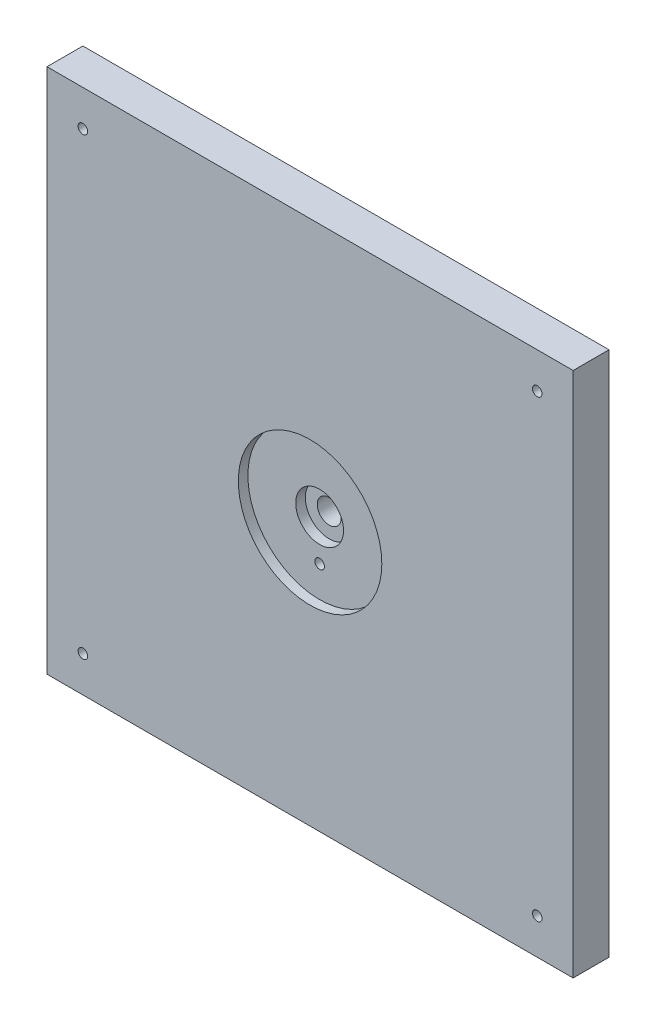
ISO-10303-21;
HEADER;
FILE_DESCRIPTION(('STEP AP214'),'2;1');
FILE_NAME('part.step','',(''),(''),'','','');
FILE_SCHEMA(('AUTOMOTIVE_DESIGN { 1 0 10303 214 1 1 1 1 }'));
ENDSEC;
DATA;
#1=APPLICATION_CONTEXT('core data for automotive mechanical design processes');
#2=APPLICATION_PROTOCOL_DEFINITION('international standard','automotive_design',2000,#1);
#3=PRODUCT_CONTEXT('',#1,'mechanical');
#4=PRODUCT('Part','Part','',(#3));
#5=PRODUCT_RELATED_PRODUCT_CATEGORY('part','',(#4));
#6=PRODUCT_DEFINITION_FORMATION('','',#4);
#7=PRODUCT_DEFINITION_CONTEXT('part definition',#1,'design');
#8=PRODUCT_DEFINITION('design','',#6,#7);
#9=PRODUCT_DEFINITION_SHAPE('','',#8);
#10=(LENGTH_UNIT() NAMED_UNIT(*) SI_UNIT(.MILLI.,.METRE.));
#11=(NAMED_UNIT(*) PLANE_ANGLE_UNIT() SI_UNIT($,.RADIAN.));
#12=(NAMED_UNIT(*) SI_UNIT($,.STERADIAN.) SOLID_ANGLE_UNIT());
#13=UNCERTAINTY_MEASURE_WITH_UNIT(LENGTH_MEASURE(1.E-05),#10,'distance_accuracy_value','');
#14=(GEOMETRIC_REPRESENTATION_CONTEXT(3) GLOBAL_UNCERTAINTY_ASSIGNED_CONTEXT((#13)) GLOBAL_UNIT_ASSIGNED_CONTEXT((#10,
#11,#12)) REPRESENTATION_CONTEXT('',''));
#15=CARTESIAN_POINT('',(0.,0.,0.));
#16=DIRECTION('',(0.,0.,1.));
#17=DIRECTION('',(1.,0.,0.));
#18=AXIS2_PLACEMENT_3D('',#15,#16,#17);
#19=CARTESIAN_POINT('',(-139.7,139.7,19.05));
#20=DIRECTION('',(1.,0.,0.));
#21=DIRECTION('',(0.,1.,0.));
#22=AXIS2_PLACEMENT_3D('',#19,#20,#21);
#23=PLANE('',#22);
#24=DIRECTION('',(0.,-1.,0.));
#25=VECTOR('',#24,1.);
#26=CARTESIAN_POINT('',(-139.7,139.7,0.));
#27=LINE('',#26,#25);
#28=CARTESIAN_POINT('',(-139.7,139.7,0.));
#29=VERTEX_POINT('',#28);
#30=CARTESIAN_POINT('',(-139.7,-139.7,0.));
#31=VERTEX_POINT('',#30);
#32=EDGE_CURVE('E99',#29,#31,#27,.T.);
#33=ORIENTED_EDGE('',*,*,#32,.T.);
#34=DIRECTION('',(0.,0.,-1.));
#35=VECTOR('',#34,1.);
#36=CARTESIAN_POINT('',(-139.7,-139.7,19.05));
#37=LINE('',#36,#35);
#38=CARTESIAN_POINT('',(-139.7,-139.7,19.05));
#39=VERTEX_POINT('',#38);
#40=EDGE_CURVE('E11',#39,#31,#37,.T.);
#41=ORIENTED_EDGE('',*,*,#40,.F.);
#42=DIRECTION('',(0.,-1.,0.));
#43=VECTOR('',#42,1.);
#44=CARTESIAN_POINT('',(-139.7,139.7,19.05));
#45=LINE('',#44,#43);
#46=CARTESIAN_POINT('',(-139.7,139.7,19.05));
#47=VERTEX_POINT('',#46);
#48=EDGE_CURVE('E86',#47,#39,#45,.T.);
#49=ORIENTED_EDGE('',*,*,#48,.F.);
#50=DIRECTION('',(0.,0.,-1.));
#51=VECTOR('',#50,1.);
#52=CARTESIAN_POINT('',(-139.7,139.7,19.05));
#53=LINE('',#52,#51);
#54=EDGE_CURVE('E95',#47,#29,#53,.T.);
#55=ORIENTED_EDGE('',*,*,#54,.T.);
#56=EDGE_LOOP('',(#33,#41,#49,#55));
#57=FACE_BOUND('',#56,.T.);
#58=ADVANCED_FACE('F33',(#57),#23,.F.);
#59=CARTESIAN_POINT('',(-139.7,-139.7,19.05));
#60=DIRECTION('',(0.,1.,0.));
#61=DIRECTION('',(0.,0.,1.));
#62=AXIS2_PLACEMENT_3D('',#59,#60,#61);
#63=PLANE('',#62);
#64=DIRECTION('',(1.,0.,0.));
#65=VECTOR('',#64,1.);
#66=CARTESIAN_POINT('',(-139.7,-139.7,0.));
#67=LINE('',#66,#65);
#68=CARTESIAN_POINT('',(139.7,-139.7,0.));
#69=VERTEX_POINT('',#68);
#70=EDGE_CURVE('E90',#31,#69,#67,.T.);
#71=ORIENTED_EDGE('',*,*,#70,.T.);
#72=DIRECTION('',(0.,0.,-1.));
#73=VECTOR('',#72,1.);
#74=CARTESIAN_POINT('',(139.7,-139.7,19.05));
#75=LINE('',#74,#73);
#76=CARTESIAN_POINT('',(139.7,-139.7,19.05));
#77=VERTEX_POINT('',#76);
#78=EDGE_CURVE('E42',#77,#69,#75,.T.);
#79=ORIENTED_EDGE('',*,*,#78,.F.);
#80=DIRECTION('',(1.,0.,0.));
#81=VECTOR('',#80,1.);
#82=CARTESIAN_POINT('',(-139.7,-139.7,19.05));
#83=LINE('',#82,#81);
#84=EDGE_CURVE('E81',#39,#77,#83,.T.);
#85=ORIENTED_EDGE('',*,*,#84,.F.);
#86=ORIENTED_EDGE('',*,*,#40,.T.);
#87=EDGE_LOOP('',(#71,#79,#85,#86));
#88=FACE_BOUND('',#87,.T.);
#89=ADVANCED_FACE('F89',(#88),#63,.F.);
#90=CARTESIAN_POINT('',(139.7,139.7,19.05));
#91=DIRECTION('',(-1.,0.,0.));
#92=DIRECTION('',(0.,-1.,0.));
#93=AXIS2_PLACEMENT_3D('',#90,#91,#92);
#94=PLANE('',#93);
#95=DIRECTION('',(0.,1.,0.));
#96=VECTOR('',#95,1.);
#97=CARTESIAN_POINT('',(139.7,139.7,0.));
#98=LINE('',#97,#96);
#99=CARTESIAN_POINT('',(139.7,139.7,0.));
#100=VERTEX_POINT('',#99);
#101=EDGE_CURVE('E68',#69,#100,#98,.T.);
#102=ORIENTED_EDGE('',*,*,#101,.T.);
#103=DIRECTION('',(0.,0.,-1.));
#104=VECTOR('',#103,1.);
#105=CARTESIAN_POINT('',(139.7,139.7,19.05));
#106=LINE('',#105,#104);
#107=CARTESIAN_POINT('',(139.7,139.7,19.05));
#108=VERTEX_POINT('',#107);
#109=EDGE_CURVE('E91',#108,#100,#106,.T.);
#110=ORIENTED_EDGE('',*,*,#109,.F.);
#111=DIRECTION('',(0.,1.,0.));
#112=VECTOR('',#111,1.);
#113=CARTESIAN_POINT('',(139.7,139.7,19.05));
#114=LINE('',#113,#112);
#115=EDGE_CURVE('E84',#77,#108,#114,.T.);
#116=ORIENTED_EDGE('',*,*,#115,.F.);
#117=ORIENTED_EDGE('',*,*,#78,.T.);
#118=EDGE_LOOP('',(#102,#110,#116,#117));
#119=FACE_BOUND('',#118,.T.);
#120=ADVANCED_FACE('F93',(#119),#94,.F.);
#121=CARTESIAN_POINT('',(-139.7,139.7,19.05));
#122=DIRECTION('',(0.,-1.,0.));
#123=DIRECTION('',(0.,0.,-1.));
#124=AXIS2_PLACEMENT_3D('',#121,#122,#123);
#125=PLANE('',#124);
#126=DIRECTION('',(-1.,0.,0.));
#127=VECTOR('',#126,1.);
#128=CARTESIAN_POINT('',(-139.7,139.7,0.));
#129=LINE('',#128,#127);
#130=EDGE_CURVE('E74',#100,#29,#129,.T.);
#131=ORIENTED_EDGE('',*,*,#130,.T.);
#132=ORIENTED_EDGE('',*,*,#54,.F.);
#133=DIRECTION('',(-1.,0.,0.));
#134=VECTOR('',#133,1.);
#135=CARTESIAN_POINT('',(-139.7,139.7,19.05));
#136=LINE('',#135,#134);
#137=EDGE_CURVE('E51',#108,#47,#136,.T.);
#138=ORIENTED_EDGE('',*,*,#137,.F.);
#139=ORIENTED_EDGE('',*,*,#109,.T.);
#140=EDGE_LOOP('',(#131,#132,#138,#139));
#141=FACE_BOUND('',#140,.T.);
#142=ADVANCED_FACE('F178',(#141),#125,.F.);
#143=CARTESIAN_POINT('',(0.,0.,19.05));
#144=DIRECTION('',(0.,0.,1.));
#145=DIRECTION('',(1.,0.,0.));
#146=AXIS2_PLACEMENT_3D('',#143,#144,#145);
#147=PLANE('',#146);
#148=CARTESIAN_POINT('',(120.65,-120.65,19.05));
#149=DIRECTION('',(0.,0.,1.));
#150=DIRECTION('',(1.,0.,0.));
#151=AXIS2_PLACEMENT_3D('',#148,#149,#150);
#152=CIRCLE('',#151,2.53999999999999);
#153=CARTESIAN_POINT('',(123.19,-120.65,19.05));
#154=VERTEX_POINT('',#153);
#155=EDGE_CURVE('E306',#154,#154,#152,.T.);
#156=ORIENTED_EDGE('',*,*,#155,.F.);
#157=EDGE_LOOP('',(#156));
#158=FACE_BOUND('',#157,.T.);
#159=CARTESIAN_POINT('',(120.65,120.65,19.05));
#160=DIRECTION('',(0.,0.,1.));
#161=DIRECTION('',(1.,0.,0.));
#162=AXIS2_PLACEMENT_3D('',#159,#160,#161);
#163=CIRCLE('',#162,2.53999999999999);
#164=CARTESIAN_POINT('',(123.19,120.65,19.05));
#165=VERTEX_POINT('',#164);
#166=EDGE_CURVE('E309',#165,#165,#163,.T.);
#167=ORIENTED_EDGE('',*,*,#166,.F.);
#168=EDGE_LOOP('',(#167));
#169=FACE_BOUND('',#168,.T.);
#170=CARTESIAN_POINT('',(-120.65,120.65,19.05));
#171=DIRECTION('',(0.,0.,1.));
#172=DIRECTION('',(1.,0.,0.));
#173=AXIS2_PLACEMENT_3D('',#170,#171,#172);
#174=CIRCLE('',#173,2.53999999999999);
#175=CARTESIAN_POINT('',(-118.11,120.65,19.05));
#176=VERTEX_POINT('',#175);
#177=EDGE_CURVE('E311',#176,#176,#174,.T.);
#178=ORIENTED_EDGE('',*,*,#177,.F.);
#179=EDGE_LOOP('',(#178));
#180=FACE_BOUND('',#179,.T.);
#181=CARTESIAN_POINT('',(-120.65,-120.65,19.05));
#182=DIRECTION('',(0.,0.,1.));
#183=DIRECTION('',(1.,0.,0.));
#184=AXIS2_PLACEMENT_3D('',#181,#182,#183);
#185=CIRCLE('',#184,2.53999999999999);
#186=CARTESIAN_POINT('',(-118.11,-120.65,19.05));
#187=VERTEX_POINT('',#186);
#188=EDGE_CURVE('E121',#187,#187,#185,.T.);
#189=ORIENTED_EDGE('',*,*,#188,.F.);
#190=EDGE_LOOP('',(#189));
#191=FACE_BOUND('',#190,.T.);
#192=CARTESIAN_POINT('',(0.,0.,19.05));
#193=DIRECTION('',(0.,0.,1.));
#194=DIRECTION('',(1.,0.,0.));
#195=AXIS2_PLACEMENT_3D('',#192,#193,#194);
#196=CIRCLE('',#195,38.1);
#197=CARTESIAN_POINT('',(38.1,0.,19.05));
#198=VERTEX_POINT('',#197);
#199=EDGE_CURVE('E115',#198,#198,#196,.T.);
#200=ORIENTED_EDGE('',*,*,#199,.F.);
#201=EDGE_LOOP('',(#200));
#202=FACE_BOUND('',#201,.T.);
#203=ORIENTED_EDGE('',*,*,#48,.T.);
#204=ORIENTED_EDGE('',*,*,#84,.T.);
#205=ORIENTED_EDGE('',*,*,#115,.T.);
#206=ORIENTED_EDGE('',*,*,#137,.T.);
#207=EDGE_LOOP('',(#203,#204,#205,#206));
#208=FACE_BOUND('',#207,.T.);
#209=ADVANCED_FACE('F82',(#158,#169,#180,#191,#202,#208),#147,.T.);
#210=CARTESIAN_POINT('',(0.,0.,0.));
#211=DIRECTION('',(0.,0.,1.));
#212=DIRECTION('',(1.,0.,0.));
#213=AXIS2_PLACEMENT_3D('',#210,#211,#212);
#214=PLANE('',#213);
#215=CARTESIAN_POINT('',(0.,-21.59,0.));
#216=DIRECTION('',(0.,0.,1.));
#217=DIRECTION('',(1.,0.,0.));
#218=AXIS2_PLACEMENT_3D('',#215,#216,#217);
#219=CIRCLE('',#218,2.54);
#220=CARTESIAN_POINT('',(2.53999999999997,-21.59,0.));
#221=VERTEX_POINT('',#220);
#222=EDGE_CURVE('E305',#221,#221,#219,.T.);
#223=ORIENTED_EDGE('',*,*,#222,.T.);
#224=EDGE_LOOP('',(#223));
#225=FACE_BOUND('',#224,.T.);
#226=CARTESIAN_POINT('',(120.65,-120.65,0.));
#227=DIRECTION('',(0.,0.,1.));
#228=DIRECTION('',(1.,0.,0.));
#229=AXIS2_PLACEMENT_3D('',#226,#227,#228);
#230=CIRCLE('',#229,2.53999999999999);
#231=CARTESIAN_POINT('',(123.19,-120.65,0.));
#232=VERTEX_POINT('',#231);
#233=EDGE_CURVE('E126',#232,#232,#230,.T.);
#234=ORIENTED_EDGE('',*,*,#233,.T.);
#235=EDGE_LOOP('',(#234));
#236=FACE_BOUND('',#235,.T.);
#237=CARTESIAN_POINT('',(120.65,120.65,0.));
#238=DIRECTION('',(0.,0.,1.));
#239=DIRECTION('',(1.,0.,0.));
#240=AXIS2_PLACEMENT_3D('',#237,#238,#239);
#241=CIRCLE('',#240,2.53999999999999);
#242=CARTESIAN_POINT('',(123.19,120.65,0.));
#243=VERTEX_POINT('',#242);
#244=EDGE_CURVE('E124',#243,#243,#241,.T.);
#245=ORIENTED_EDGE('',*,*,#244,.T.);
#246=EDGE_LOOP('',(#245));
#247=FACE_BOUND('',#246,.T.);
#248=CARTESIAN_POINT('',(-120.65,120.65,0.));
#249=DIRECTION('',(0.,0.,1.));
#250=DIRECTION('',(1.,0.,0.));
#251=AXIS2_PLACEMENT_3D('',#248,#249,#250);
#252=CIRCLE('',#251,2.53999999999999);
#253=CARTESIAN_POINT('',(-118.11,120.65,0.));
#254=VERTEX_POINT('',#253);
#255=EDGE_CURVE('E120',#254,#254,#252,.T.);
#256=ORIENTED_EDGE('',*,*,#255,.T.);
#257=EDGE_LOOP('',(#256));
#258=FACE_BOUND('',#257,.T.);
#259=CARTESIAN_POINT('',(-120.65,-120.65,0.));
#260=DIRECTION('',(0.,0.,1.));
#261=DIRECTION('',(1.,0.,0.));
#262=AXIS2_PLACEMENT_3D('',#259,#260,#261);
#263=CIRCLE('',#262,2.53999999999999);
#264=CARTESIAN_POINT('',(-118.11,-120.65,0.));
#265=VERTEX_POINT('',#264);
#266=EDGE_CURVE('E117',#265,#265,#263,.T.);
#267=ORIENTED_EDGE('',*,*,#266,.T.);
#268=EDGE_LOOP('',(#267));
#269=FACE_BOUND('',#268,.T.);
#270=CARTESIAN_POINT('',(0.,0.,0.));
#271=DIRECTION('',(0.,0.,1.));
#272=DIRECTION('',(1.,0.,0.));
#273=AXIS2_PLACEMENT_3D('',#270,#271,#272);
#274=CIRCLE('',#273,6.35000000000002);
#275=CARTESIAN_POINT('',(6.35000000000002,0.,0.));
#276=VERTEX_POINT('',#275);
#277=EDGE_CURVE('E112',#276,#276,#274,.T.);
#278=ORIENTED_EDGE('',*,*,#277,.T.);
#279=EDGE_LOOP('',(#278));
#280=FACE_BOUND('',#279,.T.);
#281=ORIENTED_EDGE('',*,*,#32,.F.);
#282=ORIENTED_EDGE('',*,*,#130,.F.);
#283=ORIENTED_EDGE('',*,*,#101,.F.);
#284=ORIENTED_EDGE('',*,*,#70,.F.);
#285=EDGE_LOOP('',(#281,#282,#283,#284));
#286=FACE_BOUND('',#285,.T.);
#287=ADVANCED_FACE('F156',(#225,#236,#247,#258,#269,#280,#286),#214,.F.);
#288=CARTESIAN_POINT('',(0.,0.,13.97));
#289=DIRECTION('',(0.,0.,1.));
#290=DIRECTION('',(1.,0.,0.));
#291=AXIS2_PLACEMENT_3D('',#288,#289,#290);
#292=PLANE('',#291);
#293=CARTESIAN_POINT('',(0.,-21.59,13.97));
#294=DIRECTION('',(0.,0.,1.));
#295=DIRECTION('',(1.,0.,0.));
#296=AXIS2_PLACEMENT_3D('',#293,#294,#295);
#297=CIRCLE('',#296,2.54);
#298=CARTESIAN_POINT('',(2.53999999999997,-21.59,13.97));
#299=VERTEX_POINT('',#298);
#300=EDGE_CURVE('E36',#299,#299,#297,.T.);
#301=ORIENTED_EDGE('',*,*,#300,.F.);
#302=EDGE_LOOP('',(#301));
#303=FACE_BOUND('',#302,.T.);
#304=CARTESIAN_POINT('',(0.,0.,13.97));
#305=DIRECTION('',(0.,0.,1.));
#306=DIRECTION('',(1.,0.,0.));
#307=AXIS2_PLACEMENT_3D('',#304,#305,#306);
#308=CIRCLE('',#307,38.1);
#309=CARTESIAN_POINT('',(38.1,0.,13.97));
#310=VERTEX_POINT('',#309);
#311=EDGE_CURVE('E111',#310,#310,#308,.T.);
#312=ORIENTED_EDGE('',*,*,#311,.T.);
#313=EDGE_LOOP('',(#312));
#314=FACE_BOUND('',#313,.T.);
#315=CARTESIAN_POINT('',(0.,0.,13.97));
#316=DIRECTION('',(0.,0.,1.));
#317=DIRECTION('',(1.,0.,0.));
#318=AXIS2_PLACEMENT_3D('',#315,#316,#317);
#319=CIRCLE('',#318,12.7);
#320=CARTESIAN_POINT('',(12.7,0.,13.97));
#321=VERTEX_POINT('',#320);
#322=EDGE_CURVE('E108',#321,#321,#319,.F.);
#323=ORIENTED_EDGE('',*,*,#322,.T.);
#324=EDGE_LOOP('',(#323));
#325=FACE_BOUND('',#324,.T.);
#326=ADVANCED_FACE('F153',(#303,#314,#325),#292,.T.);
#327=CARTESIAN_POINT('',(0.,0.,13.97));
#328=DIRECTION('',(0.,0.,1.));
#329=DIRECTION('',(1.,0.,0.));
#330=AXIS2_PLACEMENT_3D('',#327,#328,#329);
#331=CYLINDRICAL_SURFACE('',#330,38.1);
#332=ORIENTED_EDGE('',*,*,#311,.F.);
#333=EDGE_LOOP('',(#332));
#334=FACE_BOUND('',#333,.T.);
#335=ORIENTED_EDGE('',*,*,#199,.T.);
#336=EDGE_LOOP('',(#335));
#337=FACE_BOUND('',#336,.T.);
#338=ADVANCED_FACE('F155',(#334,#337),#331,.F.);
#339=CARTESIAN_POINT('',(0.,0.,8.89));
#340=DIRECTION('',(0.,0.,1.));
#341=DIRECTION('',(1.,0.,0.));
#342=AXIS2_PLACEMENT_3D('',#339,#340,#341);
#343=PLANE('',#342);
#344=CARTESIAN_POINT('',(0.,0.,8.89));
#345=DIRECTION('',(0.,0.,1.));
#346=DIRECTION('',(1.,0.,0.));
#347=AXIS2_PLACEMENT_3D('',#344,#345,#346);
#348=CIRCLE('',#347,6.35000000000002);
#349=CARTESIAN_POINT('',(6.35000000000002,0.,8.89));
#350=VERTEX_POINT('',#349);
#351=EDGE_CURVE('E116',#350,#350,#348,.T.);
#352=ORIENTED_EDGE('',*,*,#351,.F.);
#353=EDGE_LOOP('',(#352));
#354=FACE_BOUND('',#353,.T.);
#355=CARTESIAN_POINT('',(0.,0.,8.89));
#356=DIRECTION('',(0.,0.,1.));
#357=DIRECTION('',(1.,0.,0.));
#358=AXIS2_PLACEMENT_3D('',#355,#356,#357);
#359=CIRCLE('',#358,12.7);
#360=CARTESIAN_POINT('',(12.7,0.,8.89));
#361=VERTEX_POINT('',#360);
#362=EDGE_CURVE('E102',#361,#361,#359,.T.);
#363=ORIENTED_EDGE('',*,*,#362,.T.);
#364=EDGE_LOOP('',(#363));
#365=FACE_BOUND('',#364,.T.);
#366=ADVANCED_FACE('F144',(#354,#365),#343,.T.);
#367=CARTESIAN_POINT('',(0.,0.,8.89));
#368=DIRECTION('',(0.,0.,1.));
#369=DIRECTION('',(1.,0.,0.));
#370=AXIS2_PLACEMENT_3D('',#367,#368,#369);
#371=CYLINDRICAL_SURFACE('',#370,12.7);
#372=ORIENTED_EDGE('',*,*,#362,.F.);
#373=EDGE_LOOP('',(#372));
#374=FACE_BOUND('',#373,.T.);
#375=ORIENTED_EDGE('',*,*,#322,.F.);
#376=EDGE_LOOP('',(#375));
#377=FACE_BOUND('',#376,.T.);
#378=ADVANCED_FACE('F146',(#374,#377),#371,.F.);
#379=CARTESIAN_POINT('',(0.,0.,-30.48));
#380=DIRECTION('',(0.,0.,1.));
#381=DIRECTION('',(1.,0.,0.));
#382=AXIS2_PLACEMENT_3D('',#379,#380,#381);
#383=CYLINDRICAL_SURFACE('',#382,6.35000000000002);
#384=ORIENTED_EDGE('',*,*,#351,.T.);
#385=EDGE_LOOP('',(#384));
#386=FACE_BOUND('',#385,.T.);
#387=ORIENTED_EDGE('',*,*,#277,.F.);
#388=EDGE_LOOP('',(#387));
#389=FACE_BOUND('',#388,.T.);
#390=ADVANCED_FACE('F149',(#386,#389),#383,.F.);
#391=CARTESIAN_POINT('',(-120.65,-120.65,-20.32));
#392=DIRECTION('',(0.,0.,1.));
#393=DIRECTION('',(1.,0.,0.));
#394=AXIS2_PLACEMENT_3D('',#391,#392,#393);
#395=CYLINDRICAL_SURFACE('',#394,2.53999999999999);
#396=ORIENTED_EDGE('',*,*,#188,.T.);
#397=EDGE_LOOP('',(#396));
#398=FACE_BOUND('',#397,.T.);
#399=ORIENTED_EDGE('',*,*,#266,.F.);
#400=EDGE_LOOP('',(#399));
#401=FACE_BOUND('',#400,.T.);
#402=ADVANCED_FACE('F205',(#398,#401),#395,.F.);
#403=CARTESIAN_POINT('',(-120.65,120.65,-20.32));
#404=DIRECTION('',(0.,0.,1.));
#405=DIRECTION('',(1.,0.,0.));
#406=AXIS2_PLACEMENT_3D('',#403,#404,#405);
#407=CYLINDRICAL_SURFACE('',#406,2.53999999999999);
#408=ORIENTED_EDGE('',*,*,#177,.T.);
#409=EDGE_LOOP('',(#408));
#410=FACE_BOUND('',#409,.T.);
#411=ORIENTED_EDGE('',*,*,#255,.F.);
#412=EDGE_LOOP('',(#411));
#413=FACE_BOUND('',#412,.T.);
#414=ADVANCED_FACE('F212',(#410,#413),#407,.F.);
#415=CARTESIAN_POINT('',(120.65,120.65,-20.32));
#416=DIRECTION('',(0.,0.,1.));
#417=DIRECTION('',(1.,0.,0.));
#418=AXIS2_PLACEMENT_3D('',#415,#416,#417);
#419=CYLINDRICAL_SURFACE('',#418,2.53999999999999);
#420=ORIENTED_EDGE('',*,*,#166,.T.);
#421=EDGE_LOOP('',(#420));
#422=FACE_BOUND('',#421,.T.);
#423=ORIENTED_EDGE('',*,*,#244,.F.);
#424=EDGE_LOOP('',(#423));
#425=FACE_BOUND('',#424,.T.);
#426=ADVANCED_FACE('F220',(#422,#425),#419,.F.);
#427=CARTESIAN_POINT('',(120.65,-120.65,-20.32));
#428=DIRECTION('',(0.,0.,1.));
#429=DIRECTION('',(1.,0.,0.));
#430=AXIS2_PLACEMENT_3D('',#427,#428,#429);
#431=CYLINDRICAL_SURFACE('',#430,2.53999999999999);
#432=ORIENTED_EDGE('',*,*,#155,.T.);
#433=EDGE_LOOP('',(#432));
#434=FACE_BOUND('',#433,.T.);
#435=ORIENTED_EDGE('',*,*,#233,.F.);
#436=EDGE_LOOP('',(#435));
#437=FACE_BOUND('',#436,.T.);
#438=ADVANCED_FACE('F228',(#434,#437),#431,.F.);
#439=CARTESIAN_POINT('',(0.,-21.59,-17.526));
#440=DIRECTION('',(0.,0.,1.));
#441=DIRECTION('',(1.,0.,0.));
#442=AXIS2_PLACEMENT_3D('',#439,#440,#441);
#443=CYLINDRICAL_SURFACE('',#442,2.54);
#444=ORIENTED_EDGE('',*,*,#300,.T.);
#445=EDGE_LOOP('',(#444));
#446=FACE_BOUND('',#445,.T.);
#447=ORIENTED_EDGE('',*,*,#222,.F.);
#448=EDGE_LOOP('',(#447));
#449=FACE_BOUND('',#448,.T.);
#450=ADVANCED_FACE('F236',(#446,#449),#443,.F.);
#451=CLOSED_SHELL('',(#58,#89,#120,#142,#209,#287,#326,#338,#366,#378,#390,#402,#414,#426,#438,#450));
#452=MANIFOLD_SOLID_BREP('B2',#451);
#453=ADVANCED_BREP_SHAPE_REPRESENTATION('',(#18,#452),#14);
#454=SHAPE_DEFINITION_REPRESENTATION(#9,#453);
ENDSEC;
END-ISO-10303-21;
